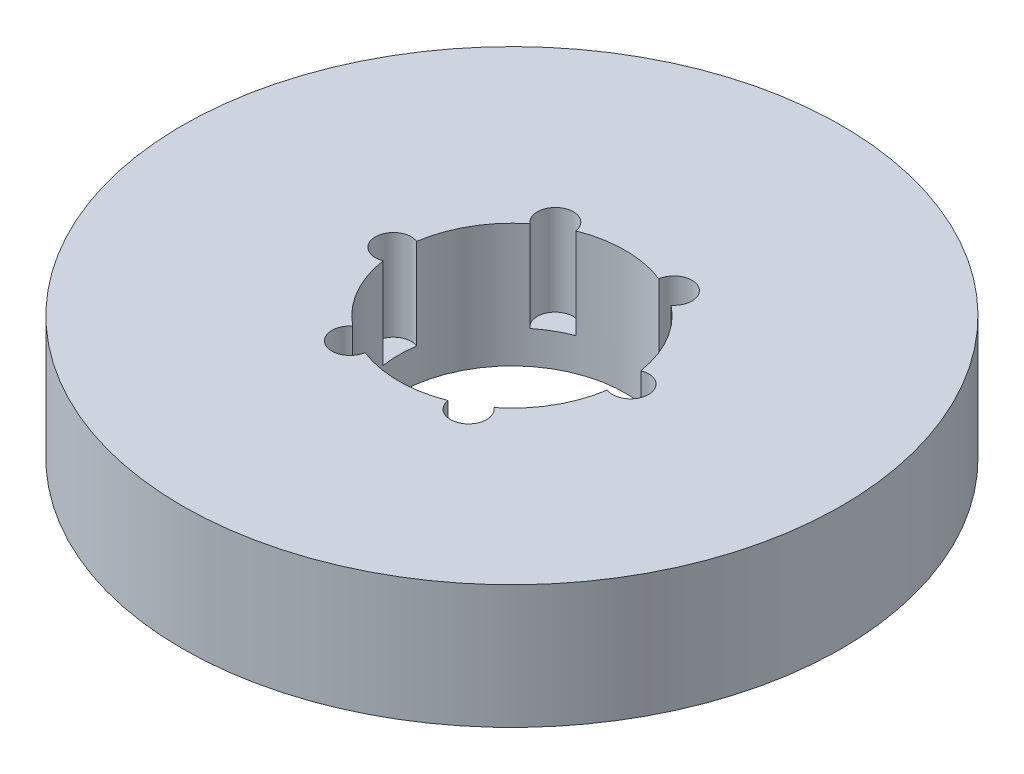
ISO-10303-21;
HEADER;
FILE_DESCRIPTION(('STEP AP214'),'2;1');
FILE_NAME('part.step','',(''),(''),'','','');
FILE_SCHEMA(('AUTOMOTIVE_DESIGN { 1 0 10303 214 1 1 1 1 }'));
ENDSEC;
DATA;
#1=APPLICATION_CONTEXT('core data for automotive mechanical design processes');
#2=APPLICATION_PROTOCOL_DEFINITION('international standard','automotive_design',2000,#1);
#3=PRODUCT_CONTEXT('',#1,'mechanical');
#4=PRODUCT('Part','Part','',(#3));
#5=PRODUCT_RELATED_PRODUCT_CATEGORY('part','',(#4));
#6=PRODUCT_DEFINITION_FORMATION('','',#4);
#7=PRODUCT_DEFINITION_CONTEXT('part definition',#1,'design');
#8=PRODUCT_DEFINITION('design','',#6,#7);
#9=PRODUCT_DEFINITION_SHAPE('','',#8);
#10=(LENGTH_UNIT() NAMED_UNIT(*) SI_UNIT(.MILLI.,.METRE.));
#11=(NAMED_UNIT(*) PLANE_ANGLE_UNIT() SI_UNIT($,.RADIAN.));
#12=(NAMED_UNIT(*) SI_UNIT($,.STERADIAN.) SOLID_ANGLE_UNIT());
#13=UNCERTAINTY_MEASURE_WITH_UNIT(LENGTH_MEASURE(1.E-05),#10,'distance_accuracy_value','');
#14=(GEOMETRIC_REPRESENTATION_CONTEXT(3) GLOBAL_UNCERTAINTY_ASSIGNED_CONTEXT((#13)) GLOBAL_UNIT_ASSIGNED_CONTEXT((#10,
#11,#12)) REPRESENTATION_CONTEXT('',''));
#15=CARTESIAN_POINT('',(0.,0.,0.));
#16=DIRECTION('',(0.,0.,1.));
#17=DIRECTION('',(1.,0.,0.));
#18=AXIS2_PLACEMENT_3D('',#15,#16,#17);
#19=CARTESIAN_POINT('',(0.,30.,0.));
#20=DIRECTION('',(0.,-1.,0.));
#21=DIRECTION('',(0.,0.,-1.));
#22=AXIS2_PLACEMENT_3D('',#19,#20,#21);
#23=CYLINDRICAL_SURFACE('',#22,80.);
#24=CARTESIAN_POINT('',(0.,30.,0.));
#25=DIRECTION('',(0.,1.,0.));
#26=DIRECTION('',(0.,0.,1.));
#27=AXIS2_PLACEMENT_3D('',#24,#25,#26);
#28=CIRCLE('',#27,80.);
#29=CARTESIAN_POINT('',(0.,30.,80.));
#30=VERTEX_POINT('',#29);
#31=EDGE_CURVE('E171',#30,#30,#28,.T.);
#32=ORIENTED_EDGE('',*,*,#31,.F.);
#33=EDGE_LOOP('',(#32));
#34=FACE_BOUND('',#33,.T.);
#35=CARTESIAN_POINT('',(0.,0.,0.));
#36=DIRECTION('',(0.,1.,0.));
#37=DIRECTION('',(0.,0.,1.));
#38=AXIS2_PLACEMENT_3D('',#35,#36,#37);
#39=CIRCLE('',#38,80.);
#40=CARTESIAN_POINT('',(0.,0.,80.));
#41=VERTEX_POINT('',#40);
#42=EDGE_CURVE('E157',#41,#41,#39,.T.);
#43=ORIENTED_EDGE('',*,*,#42,.T.);
#44=EDGE_LOOP('',(#43));
#45=FACE_BOUND('',#44,.T.);
#46=ADVANCED_FACE('F39',(#34,#45),#23,.T.);
#47=CARTESIAN_POINT('',(0.,30.,0.));
#48=DIRECTION('',(0.,1.,0.));
#49=DIRECTION('',(0.,0.,1.));
#50=AXIS2_PLACEMENT_3D('',#47,#48,#49);
#51=PLANE('',#50);
#52=CARTESIAN_POINT('',(-14.3917076225859,30.,-24.9271688099943));
#53=DIRECTION('',(0.,1.,0.));
#54=DIRECTION('',(-0.866025403784433,0.,0.50000000000001));
#55=AXIS2_PLACEMENT_3D('',#52,#53,#54);
#56=CIRCLE('',#55,4.37670351612695);
#57=CARTESIAN_POINT('',(-10.0657349924018,30.,-25.5916193130239));
#58=VERTEX_POINT('',#57);
#59=CARTESIAN_POINT('',(-17.1301249528588,30.,-21.5129918676935));
#60=VERTEX_POINT('',#59);
#61=EDGE_CURVE('E214',#58,#60,#56,.T.);
#62=ORIENTED_EDGE('',*,*,#61,.F.);
#63=CARTESIAN_POINT('',(0.,30.,0.));
#64=DIRECTION('',(0.,1.,0.));
#65=DIRECTION('',(0.,0.,1.));
#66=AXIS2_PLACEMENT_3D('',#63,#64,#65);
#67=CIRCLE('',#66,27.5);
#68=CARTESIAN_POINT('',(10.0657349924013,30.,-25.5916193130241));
#69=VERTEX_POINT('',#68);
#70=EDGE_CURVE('E272',#69,#58,#67,.T.);
#71=ORIENTED_EDGE('',*,*,#70,.F.);
#72=CARTESIAN_POINT('',(14.3917076225853,30.,-24.9271688099946));
#73=DIRECTION('',(0.,1.,0.));
#74=DIRECTION('',(-0.866025403784443,0.,-0.499999999999992));
#75=AXIS2_PLACEMENT_3D('',#72,#73,#74);
#76=CIRCLE('',#75,4.37670351612695);
#77=CARTESIAN_POINT('',(17.1301249528583,30.,-21.5129918676938));
#78=VERTEX_POINT('',#77);
#79=EDGE_CURVE('E285',#78,#69,#76,.T.);
#80=ORIENTED_EDGE('',*,*,#79,.F.);
#81=CARTESIAN_POINT('',(27.19585994526,30.,-4.07862744533036));
#82=VERTEX_POINT('',#81);
#83=EDGE_CURVE('E165',#82,#78,#67,.T.);
#84=ORIENTED_EDGE('',*,*,#83,.F.);
#85=CARTESIAN_POINT('',(28.7834152451711,30.,0.));
#86=DIRECTION('',(0.,1.,0.));
#87=DIRECTION('',(0.,0.,-1.));
#88=AXIS2_PLACEMENT_3D('',#85,#86,#87);
#89=CIRCLE('',#88,4.37670351612695);
#90=CARTESIAN_POINT('',(27.19585994526,30.,4.07862744533036));
#91=VERTEX_POINT('',#90);
#92=EDGE_CURVE('E281',#91,#82,#89,.T.);
#93=ORIENTED_EDGE('',*,*,#92,.F.);
#94=CARTESIAN_POINT('',(17.1301249528586,30.,21.5129918676936));
#95=VERTEX_POINT('',#94);
#96=EDGE_CURVE('E160',#95,#91,#67,.T.);
#97=ORIENTED_EDGE('',*,*,#96,.F.);
#98=CARTESIAN_POINT('',(14.3917076225857,30.,24.9271688099944));
#99=DIRECTION('',(0.,1.,0.));
#100=DIRECTION('',(0.866025403784436,0.,-0.500000000000004));
#101=AXIS2_PLACEMENT_3D('',#98,#99,#100);
#102=CIRCLE('',#101,4.37670351612695);
#103=CARTESIAN_POINT('',(10.0657349924016,30.,25.591619313024));
#104=VERTEX_POINT('',#103);
#105=EDGE_CURVE('E154',#104,#95,#102,.T.);
#106=ORIENTED_EDGE('',*,*,#105,.F.);
#107=CARTESIAN_POINT('',(-10.0657349924014,30.,25.591619313024));
#108=VERTEX_POINT('',#107);
#109=EDGE_CURVE('E150',#108,#104,#67,.T.);
#110=ORIENTED_EDGE('',*,*,#109,.F.);
#111=CARTESIAN_POINT('',(-14.3917076225855,30.,24.9271688099945));
#112=DIRECTION('',(0.,1.,0.));
#113=DIRECTION('',(0.86602540378444,0.,0.499999999999998));
#114=AXIS2_PLACEMENT_3D('',#111,#112,#113);
#115=CIRCLE('',#114,4.37670351612695);
#116=CARTESIAN_POINT('',(-17.1301249528585,30.,21.5129918676937));
#117=VERTEX_POINT('',#116);
#118=EDGE_CURVE('E127',#117,#108,#115,.T.);
#119=ORIENTED_EDGE('',*,*,#118,.F.);
#120=CARTESIAN_POINT('',(-27.19585994526,30.,4.07862744533036));
#121=VERTEX_POINT('',#120);
#122=EDGE_CURVE('E156',#121,#117,#67,.T.);
#123=ORIENTED_EDGE('',*,*,#122,.F.);
#124=CARTESIAN_POINT('',(-28.7834152451711,30.,0.));
#125=DIRECTION('',(0.,1.,0.));
#126=DIRECTION('',(0.,0.,1.));
#127=AXIS2_PLACEMENT_3D('',#124,#125,#126);
#128=CIRCLE('',#127,4.37670351612695);
#129=CARTESIAN_POINT('',(-27.19585994526,30.,-4.07862744533036));
#130=VERTEX_POINT('',#129);
#131=EDGE_CURVE('E164',#130,#121,#128,.T.);
#132=ORIENTED_EDGE('',*,*,#131,.F.);
#133=EDGE_CURVE('E159',#60,#130,#67,.T.);
#134=ORIENTED_EDGE('',*,*,#133,.F.);
#135=EDGE_LOOP('',(#62,#71,#80,#84,#93,#97,#106,#110,#119,#123,#132,#134));
#136=FACE_BOUND('',#135,.T.);
#137=ORIENTED_EDGE('',*,*,#31,.T.);
#138=EDGE_LOOP('',(#137));
#139=FACE_BOUND('',#138,.T.);
#140=ADVANCED_FACE('F155',(#136,#139),#51,.T.);
#141=CARTESIAN_POINT('',(0.,0.,0.));
#142=DIRECTION('',(0.,1.,0.));
#143=DIRECTION('',(0.,0.,1.));
#144=AXIS2_PLACEMENT_3D('',#141,#142,#143);
#145=PLANE('',#144);
#146=CARTESIAN_POINT('',(0.,0.,0.));
#147=DIRECTION('',(0.,1.,0.));
#148=DIRECTION('',(0.,0.,1.));
#149=AXIS2_PLACEMENT_3D('',#146,#147,#148);
#150=CIRCLE('',#149,27.5);
#151=CARTESIAN_POINT('',(0.,0.,27.5));
#152=VERTEX_POINT('',#151);
#153=EDGE_CURVE('E170',#152,#152,#150,.T.);
#154=ORIENTED_EDGE('',*,*,#153,.T.);
#155=EDGE_LOOP('',(#154));
#156=FACE_BOUND('',#155,.T.);
#157=ORIENTED_EDGE('',*,*,#42,.F.);
#158=EDGE_LOOP('',(#157));
#159=FACE_BOUND('',#158,.T.);
#160=ADVANCED_FACE('F232',(#156,#159),#145,.F.);
#161=CARTESIAN_POINT('',(0.,30.,0.));
#162=DIRECTION('',(0.,-1.,0.));
#163=DIRECTION('',(0.,0.,-1.));
#164=AXIS2_PLACEMENT_3D('',#161,#162,#163);
#165=CYLINDRICAL_SURFACE('',#164,27.5);
#166=DIRECTION('',(0.,1.,0.));
#167=VECTOR('',#166,1.);
#168=CARTESIAN_POINT('',(-10.0657349924018,18.9974859127144,-25.5916193130239));
#169=LINE('',#168,#167);
#170=CARTESIAN_POINT('',(-10.0657349924018,7.99497182542878,-25.5916193130239));
#171=VERTEX_POINT('',#170);
#172=EDGE_CURVE('E11',#171,#58,#169,.T.);
#173=ORIENTED_EDGE('',*,*,#172,.F.);
#174=CARTESIAN_POINT('',(0.,7.99497182542878,0.));
#175=DIRECTION('',(0.,1.,0.));
#176=DIRECTION('',(0.,0.,1.));
#177=AXIS2_PLACEMENT_3D('',#174,#175,#176);
#178=CIRCLE('',#177,27.5);
#179=CARTESIAN_POINT('',(-17.1301249528588,7.99497182542878,-21.5129918676935));
#180=VERTEX_POINT('',#179);
#181=EDGE_CURVE('E209',#171,#180,#178,.T.);
#182=ORIENTED_EDGE('',*,*,#181,.T.);
#183=DIRECTION('',(0.,1.,0.));
#184=VECTOR('',#183,1.);
#185=CARTESIAN_POINT('',(-17.1301249528588,18.9974859127144,-21.5129918676935));
#186=LINE('',#185,#184);
#187=EDGE_CURVE('E46',#60,#180,#186,.F.);
#188=ORIENTED_EDGE('',*,*,#187,.F.);
#189=ORIENTED_EDGE('',*,*,#133,.T.);
#190=DIRECTION('',(0.,1.,0.));
#191=VECTOR('',#190,1.);
#192=CARTESIAN_POINT('',(-27.19585994526,18.9974859127144,-4.07862744533036));
#193=LINE('',#192,#191);
#194=CARTESIAN_POINT('',(-27.19585994526,7.99497182542878,-4.07862744533036));
#195=VERTEX_POINT('',#194);
#196=EDGE_CURVE('E185',#195,#130,#193,.T.);
#197=ORIENTED_EDGE('',*,*,#196,.F.);
#198=CARTESIAN_POINT('',(0.,7.99497182542878,0.));
#199=DIRECTION('',(0.,1.,0.));
#200=DIRECTION('',(0.,0.,1.));
#201=AXIS2_PLACEMENT_3D('',#198,#199,#200);
#202=CIRCLE('',#201,27.5);
#203=CARTESIAN_POINT('',(-27.19585994526,7.99497182542878,4.07862744533036));
#204=VERTEX_POINT('',#203);
#205=EDGE_CURVE('E173',#195,#204,#202,.T.);
#206=ORIENTED_EDGE('',*,*,#205,.T.);
#207=DIRECTION('',(0.,1.,0.));
#208=VECTOR('',#207,1.);
#209=CARTESIAN_POINT('',(-27.19585994526,18.9974859127144,4.07862744533036));
#210=LINE('',#209,#208);
#211=EDGE_CURVE('E178',#121,#204,#210,.F.);
#212=ORIENTED_EDGE('',*,*,#211,.F.);
#213=ORIENTED_EDGE('',*,*,#122,.T.);
#214=DIRECTION('',(0.,1.,0.));
#215=VECTOR('',#214,1.);
#216=CARTESIAN_POINT('',(-17.1301249528585,18.9974859127144,21.5129918676937));
#217=LINE('',#216,#215);
#218=CARTESIAN_POINT('',(-17.1301249528585,7.99497182542878,21.5129918676937));
#219=VERTEX_POINT('',#218);
#220=EDGE_CURVE('E132',#219,#117,#217,.T.);
#221=ORIENTED_EDGE('',*,*,#220,.F.);
#222=CARTESIAN_POINT('',(0.,7.99497182542878,0.));
#223=DIRECTION('',(0.,1.,0.));
#224=DIRECTION('',(0.,0.,1.));
#225=AXIS2_PLACEMENT_3D('',#222,#223,#224);
#226=CIRCLE('',#225,27.5);
#227=CARTESIAN_POINT('',(-10.0657349924014,7.99497182542878,25.591619313024));
#228=VERTEX_POINT('',#227);
#229=EDGE_CURVE('E146',#219,#228,#226,.T.);
#230=ORIENTED_EDGE('',*,*,#229,.T.);
#231=DIRECTION('',(0.,1.,0.));
#232=VECTOR('',#231,1.);
#233=CARTESIAN_POINT('',(-10.0657349924014,18.9974859127144,25.5916193130241));
#234=LINE('',#233,#232);
#235=EDGE_CURVE('E128',#108,#228,#234,.F.);
#236=ORIENTED_EDGE('',*,*,#235,.F.);
#237=ORIENTED_EDGE('',*,*,#109,.T.);
#238=DIRECTION('',(0.,1.,0.));
#239=VECTOR('',#238,1.);
#240=CARTESIAN_POINT('',(10.0657349924016,18.9974859127144,25.591619313024));
#241=LINE('',#240,#239);
#242=CARTESIAN_POINT('',(10.0657349924016,7.99497182542878,25.591619313024));
#243=VERTEX_POINT('',#242);
#244=EDGE_CURVE('E192',#243,#104,#241,.T.);
#245=ORIENTED_EDGE('',*,*,#244,.F.);
#246=CARTESIAN_POINT('',(0.,7.99497182542878,0.));
#247=DIRECTION('',(0.,1.,0.));
#248=DIRECTION('',(0.,0.,1.));
#249=AXIS2_PLACEMENT_3D('',#246,#247,#248);
#250=CIRCLE('',#249,27.5);
#251=CARTESIAN_POINT('',(17.1301249528586,7.99497182542878,21.5129918676936));
#252=VERTEX_POINT('',#251);
#253=EDGE_CURVE('E190',#243,#252,#250,.T.);
#254=ORIENTED_EDGE('',*,*,#253,.T.);
#255=DIRECTION('',(0.,1.,0.));
#256=VECTOR('',#255,1.);
#257=CARTESIAN_POINT('',(17.1301249528586,18.9974859127144,21.5129918676936));
#258=LINE('',#257,#256);
#259=EDGE_CURVE('E189',#95,#252,#258,.F.);
#260=ORIENTED_EDGE('',*,*,#259,.F.);
#261=ORIENTED_EDGE('',*,*,#96,.T.);
#262=DIRECTION('',(0.,1.,0.));
#263=VECTOR('',#262,1.);
#264=CARTESIAN_POINT('',(27.19585994526,18.9974859127144,4.07862744533036));
#265=LINE('',#264,#263);
#266=CARTESIAN_POINT('',(27.19585994526,7.99497182542878,4.07862744533036));
#267=VERTEX_POINT('',#266);
#268=EDGE_CURVE('E203',#267,#91,#265,.T.);
#269=ORIENTED_EDGE('',*,*,#268,.F.);
#270=CARTESIAN_POINT('',(0.,7.99497182542878,0.));
#271=DIRECTION('',(0.,1.,0.));
#272=DIRECTION('',(0.,0.,1.));
#273=AXIS2_PLACEMENT_3D('',#270,#271,#272);
#274=CIRCLE('',#273,27.5);
#275=CARTESIAN_POINT('',(27.19585994526,7.99497182542878,-4.07862744533036));
#276=VERTEX_POINT('',#275);
#277=EDGE_CURVE('E194',#267,#276,#274,.T.);
#278=ORIENTED_EDGE('',*,*,#277,.T.);
#279=DIRECTION('',(0.,1.,0.));
#280=VECTOR('',#279,1.);
#281=CARTESIAN_POINT('',(27.19585994526,18.9974859127144,-4.07862744533036));
#282=LINE('',#281,#280);
#283=EDGE_CURVE('E196',#82,#276,#282,.F.);
#284=ORIENTED_EDGE('',*,*,#283,.F.);
#285=ORIENTED_EDGE('',*,*,#83,.T.);
#286=DIRECTION('',(0.,1.,0.));
#287=VECTOR('',#286,1.);
#288=CARTESIAN_POINT('',(17.1301249528583,18.9974859127144,-21.5129918676938));
#289=LINE('',#288,#287);
#290=CARTESIAN_POINT('',(17.1301249528583,7.99497182542878,-21.5129918676938));
#291=VERTEX_POINT('',#290);
#292=EDGE_CURVE('E208',#291,#78,#289,.T.);
#293=ORIENTED_EDGE('',*,*,#292,.F.);
#294=CARTESIAN_POINT('',(0.,7.99497182542878,0.));
#295=DIRECTION('',(0.,1.,0.));
#296=DIRECTION('',(0.,0.,1.));
#297=AXIS2_PLACEMENT_3D('',#294,#295,#296);
#298=CIRCLE('',#297,27.5);
#299=CARTESIAN_POINT('',(10.0657349924013,7.99497182542878,-25.5916193130241));
#300=VERTEX_POINT('',#299);
#301=EDGE_CURVE('E201',#291,#300,#298,.T.);
#302=ORIENTED_EDGE('',*,*,#301,.T.);
#303=DIRECTION('',(0.,1.,0.));
#304=VECTOR('',#303,1.);
#305=CARTESIAN_POINT('',(10.0657349924013,18.9974859127144,-25.5916193130241));
#306=LINE('',#305,#304);
#307=EDGE_CURVE('E206',#69,#300,#306,.F.);
#308=ORIENTED_EDGE('',*,*,#307,.F.);
#309=ORIENTED_EDGE('',*,*,#70,.T.);
#310=EDGE_LOOP('',(#173,#182,#188,#189,#197,#206,#212,#213,#221,#230,#236,#237,#245,#254,#260,
#261,#269,#278,#284,#285,#293,#302,#308,#309));
#311=FACE_BOUND('',#310,.T.);
#312=ORIENTED_EDGE('',*,*,#153,.F.);
#313=EDGE_LOOP('',(#312));
#314=FACE_BOUND('',#313,.T.);
#315=ADVANCED_FACE('F145',(#311,#314),#165,.F.);
#316=CARTESIAN_POINT('',(-28.7834152451711,7.99497182542878,0.));
#317=DIRECTION('',(0.,1.,0.));
#318=DIRECTION('',(0.,0.,1.));
#319=AXIS2_PLACEMENT_3D('',#316,#317,#318);
#320=CYLINDRICAL_SURFACE('',#319,4.37670351612695);
#321=ORIENTED_EDGE('',*,*,#196,.T.);
#322=ORIENTED_EDGE('',*,*,#131,.T.);
#323=ORIENTED_EDGE('',*,*,#211,.T.);
#324=CARTESIAN_POINT('',(-28.7834152451711,7.99497182542878,0.));
#325=DIRECTION('',(0.,1.,0.));
#326=DIRECTION('',(0.,0.,1.));
#327=AXIS2_PLACEMENT_3D('',#324,#325,#326);
#328=CIRCLE('',#327,4.37670351612695);
#329=EDGE_CURVE('E168',#195,#204,#328,.T.);
#330=ORIENTED_EDGE('',*,*,#329,.F.);
#331=EDGE_LOOP('',(#321,#322,#323,#330));
#332=FACE_BOUND('',#331,.T.);
#333=ADVANCED_FACE('F243',(#332),#320,.F.);
#334=CARTESIAN_POINT('',(-28.7834152451711,7.99497182542878,0.));
#335=DIRECTION('',(0.,1.,0.));
#336=DIRECTION('',(0.,0.,1.));
#337=AXIS2_PLACEMENT_3D('',#334,#335,#336);
#338=PLANE('',#337);
#339=ORIENTED_EDGE('',*,*,#329,.T.);
#340=ORIENTED_EDGE('',*,*,#205,.F.);
#341=EDGE_LOOP('',(#339,#340));
#342=FACE_BOUND('',#341,.T.);
#343=ADVANCED_FACE('F247',(#342),#338,.T.);
#344=CARTESIAN_POINT('',(-14.3917076225855,7.99497182542878,24.9271688099945));
#345=DIRECTION('',(0.,1.,0.));
#346=DIRECTION('',(0.,0.,1.));
#347=AXIS2_PLACEMENT_3D('',#344,#345,#346);
#348=CYLINDRICAL_SURFACE('',#347,4.37670351612695);
#349=ORIENTED_EDGE('',*,*,#220,.T.);
#350=ORIENTED_EDGE('',*,*,#118,.T.);
#351=ORIENTED_EDGE('',*,*,#235,.T.);
#352=CARTESIAN_POINT('',(-14.3917076225855,7.99497182542878,24.9271688099945));
#353=DIRECTION('',(0.,1.,0.));
#354=DIRECTION('',(0.86602540378444,0.,0.499999999999998));
#355=AXIS2_PLACEMENT_3D('',#352,#353,#354);
#356=CIRCLE('',#355,4.37670351612695);
#357=EDGE_CURVE('E137',#219,#228,#356,.T.);
#358=ORIENTED_EDGE('',*,*,#357,.F.);
#359=EDGE_LOOP('',(#349,#350,#351,#358));
#360=FACE_BOUND('',#359,.T.);
#361=ADVANCED_FACE('F126',(#360),#348,.F.);
#362=CARTESIAN_POINT('',(-14.3917076225855,7.99497182542878,24.9271688099945));
#363=DIRECTION('',(0.,1.,0.));
#364=DIRECTION('',(0.86602540378444,0.,0.499999999999998));
#365=AXIS2_PLACEMENT_3D('',#362,#363,#364);
#366=PLANE('',#365);
#367=ORIENTED_EDGE('',*,*,#357,.T.);
#368=ORIENTED_EDGE('',*,*,#229,.F.);
#369=EDGE_LOOP('',(#367,#368));
#370=FACE_BOUND('',#369,.T.);
#371=ADVANCED_FACE('F254',(#370),#366,.T.);
#372=CARTESIAN_POINT('',(14.3917076225857,7.99497182542878,24.9271688099944));
#373=DIRECTION('',(0.,1.,0.));
#374=DIRECTION('',(0.,0.,1.));
#375=AXIS2_PLACEMENT_3D('',#372,#373,#374);
#376=CYLINDRICAL_SURFACE('',#375,4.37670351612695);
#377=ORIENTED_EDGE('',*,*,#244,.T.);
#378=ORIENTED_EDGE('',*,*,#105,.T.);
#379=ORIENTED_EDGE('',*,*,#259,.T.);
#380=CARTESIAN_POINT('',(14.3917076225857,7.99497182542878,24.9271688099944));
#381=DIRECTION('',(0.,1.,0.));
#382=DIRECTION('',(0.866025403784436,0.,-0.500000000000004));
#383=AXIS2_PLACEMENT_3D('',#380,#381,#382);
#384=CIRCLE('',#383,4.37670351612695);
#385=EDGE_CURVE('E138',#243,#252,#384,.T.);
#386=ORIENTED_EDGE('',*,*,#385,.F.);
#387=EDGE_LOOP('',(#377,#378,#379,#386));
#388=FACE_BOUND('',#387,.T.);
#389=ADVANCED_FACE('F260',(#388),#376,.F.);
#390=CARTESIAN_POINT('',(14.3917076225857,7.99497182542878,24.9271688099944));
#391=DIRECTION('',(0.,1.,0.));
#392=DIRECTION('',(0.866025403784436,0.,-0.500000000000004));
#393=AXIS2_PLACEMENT_3D('',#390,#391,#392);
#394=PLANE('',#393);
#395=ORIENTED_EDGE('',*,*,#385,.T.);
#396=ORIENTED_EDGE('',*,*,#253,.F.);
#397=EDGE_LOOP('',(#395,#396));
#398=FACE_BOUND('',#397,.T.);
#399=ADVANCED_FACE('F265',(#398),#394,.T.);
#400=CARTESIAN_POINT('',(28.7834152451711,7.99497182542878,0.));
#401=DIRECTION('',(0.,1.,0.));
#402=DIRECTION('',(0.,0.,1.));
#403=AXIS2_PLACEMENT_3D('',#400,#401,#402);
#404=CYLINDRICAL_SURFACE('',#403,4.37670351612695);
#405=ORIENTED_EDGE('',*,*,#268,.T.);
#406=ORIENTED_EDGE('',*,*,#92,.T.);
#407=ORIENTED_EDGE('',*,*,#283,.T.);
#408=CARTESIAN_POINT('',(28.7834152451711,7.99497182542878,0.));
#409=DIRECTION('',(0.,1.,0.));
#410=DIRECTION('',(0.,0.,-1.));
#411=AXIS2_PLACEMENT_3D('',#408,#409,#410);
#412=CIRCLE('',#411,4.37670351612695);
#413=EDGE_CURVE('E287',#267,#276,#412,.T.);
#414=ORIENTED_EDGE('',*,*,#413,.F.);
#415=EDGE_LOOP('',(#405,#406,#407,#414));
#416=FACE_BOUND('',#415,.T.);
#417=ADVANCED_FACE('F300',(#416),#404,.F.);
#418=CARTESIAN_POINT('',(28.7834152451711,7.99497182542878,0.));
#419=DIRECTION('',(0.,1.,0.));
#420=DIRECTION('',(0.,0.,-1.));
#421=AXIS2_PLACEMENT_3D('',#418,#419,#420);
#422=PLANE('',#421);
#423=ORIENTED_EDGE('',*,*,#413,.T.);
#424=ORIENTED_EDGE('',*,*,#277,.F.);
#425=EDGE_LOOP('',(#423,#424));
#426=FACE_BOUND('',#425,.T.);
#427=ADVANCED_FACE('F298',(#426),#422,.T.);
#428=CARTESIAN_POINT('',(14.3917076225853,7.99497182542878,-24.9271688099946));
#429=DIRECTION('',(0.,1.,0.));
#430=DIRECTION('',(0.,0.,1.));
#431=AXIS2_PLACEMENT_3D('',#428,#429,#430);
#432=CYLINDRICAL_SURFACE('',#431,4.37670351612695);
#433=ORIENTED_EDGE('',*,*,#292,.T.);
#434=ORIENTED_EDGE('',*,*,#79,.T.);
#435=ORIENTED_EDGE('',*,*,#307,.T.);
#436=CARTESIAN_POINT('',(14.3917076225853,7.99497182542878,-24.9271688099946));
#437=DIRECTION('',(0.,1.,0.));
#438=DIRECTION('',(-0.866025403784443,0.,-0.499999999999992));
#439=AXIS2_PLACEMENT_3D('',#436,#437,#438);
#440=CIRCLE('',#439,4.37670351612695);
#441=EDGE_CURVE('E56',#291,#300,#440,.T.);
#442=ORIENTED_EDGE('',*,*,#441,.F.);
#443=EDGE_LOOP('',(#433,#434,#435,#442));
#444=FACE_BOUND('',#443,.T.);
#445=ADVANCED_FACE('F301',(#444),#432,.F.);
#446=CARTESIAN_POINT('',(14.3917076225853,7.99497182542878,-24.9271688099946));
#447=DIRECTION('',(0.,1.,0.));
#448=DIRECTION('',(-0.866025403784443,0.,-0.499999999999992));
#449=AXIS2_PLACEMENT_3D('',#446,#447,#448);
#450=PLANE('',#449);
#451=ORIENTED_EDGE('',*,*,#441,.T.);
#452=ORIENTED_EDGE('',*,*,#301,.F.);
#453=EDGE_LOOP('',(#451,#452));
#454=FACE_BOUND('',#453,.T.);
#455=ADVANCED_FACE('F221',(#454),#450,.T.);
#456=CARTESIAN_POINT('',(-14.3917076225859,7.99497182542878,-24.9271688099943));
#457=DIRECTION('',(0.,1.,0.));
#458=DIRECTION('',(0.,0.,1.));
#459=AXIS2_PLACEMENT_3D('',#456,#457,#458);
#460=CYLINDRICAL_SURFACE('',#459,4.37670351612695);
#461=ORIENTED_EDGE('',*,*,#172,.T.);
#462=ORIENTED_EDGE('',*,*,#61,.T.);
#463=ORIENTED_EDGE('',*,*,#187,.T.);
#464=CARTESIAN_POINT('',(-14.3917076225859,7.99497182542878,-24.9271688099943));
#465=DIRECTION('',(0.,1.,0.));
#466=DIRECTION('',(-0.866025403784433,0.,0.50000000000001));
#467=AXIS2_PLACEMENT_3D('',#464,#465,#466);
#468=CIRCLE('',#467,4.37670351612695);
#469=EDGE_CURVE('E55',#171,#180,#468,.T.);
#470=ORIENTED_EDGE('',*,*,#469,.F.);
#471=EDGE_LOOP('',(#461,#462,#463,#470));
#472=FACE_BOUND('',#471,.T.);
#473=ADVANCED_FACE('F212',(#472),#460,.F.);
#474=CARTESIAN_POINT('',(-14.3917076225859,7.99497182542878,-24.9271688099943));
#475=DIRECTION('',(0.,1.,0.));
#476=DIRECTION('',(-0.866025403784433,0.,0.50000000000001));
#477=AXIS2_PLACEMENT_3D('',#474,#475,#476);
#478=PLANE('',#477);
#479=ORIENTED_EDGE('',*,*,#469,.T.);
#480=ORIENTED_EDGE('',*,*,#181,.F.);
#481=EDGE_LOOP('',(#479,#480));
#482=FACE_BOUND('',#481,.T.);
#483=ADVANCED_FACE('F217',(#482),#478,.T.);
#484=CLOSED_SHELL('',(#46,#140,#160,#315,#333,#343,#361,#371,#389,#399,#417,#427,#445,#455,#473,#483));
#485=MANIFOLD_SOLID_BREP('B2',#484);
#486=ADVANCED_BREP_SHAPE_REPRESENTATION('',(#18,#485),#14);
#487=SHAPE_DEFINITION_REPRESENTATION(#9,#486);
ENDSEC;
END-ISO-10303-21;
